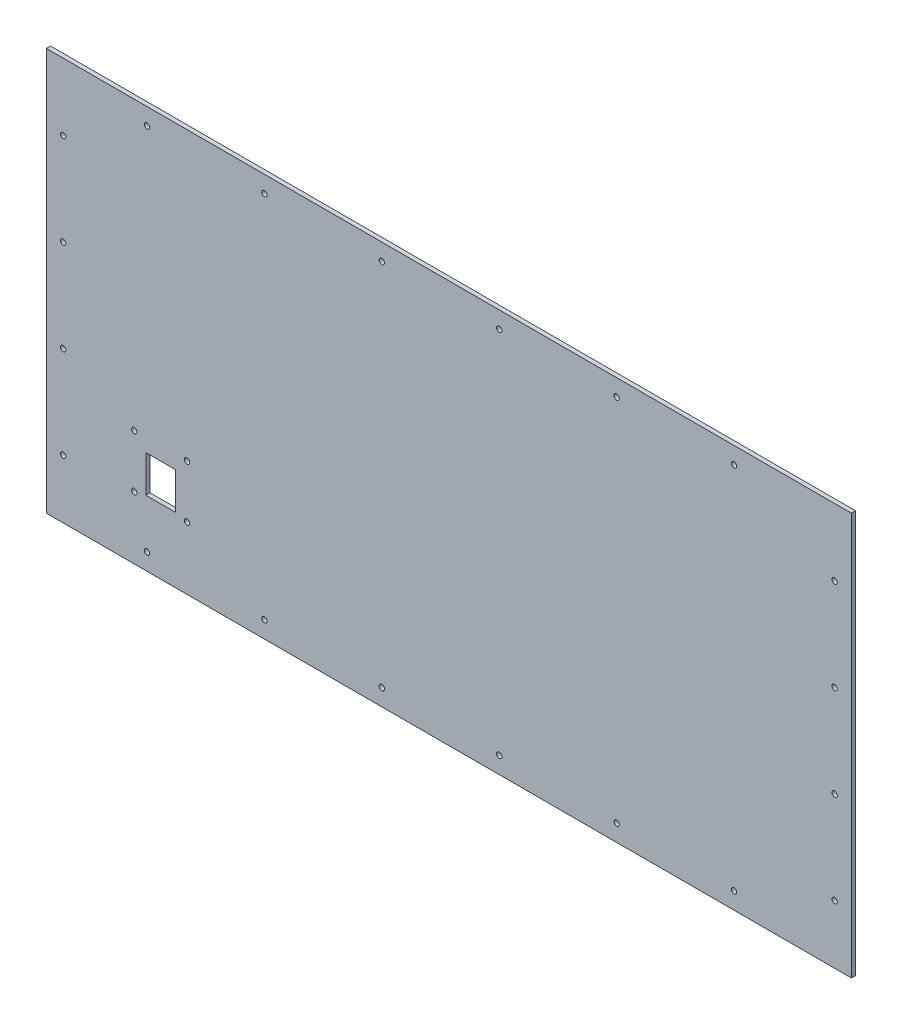
ISO-10303-21;
HEADER;
FILE_DESCRIPTION(('STEP AP214'),'2;1');
FILE_NAME('part.step','',(''),(''),'','','');
FILE_SCHEMA(('AUTOMOTIVE_DESIGN { 1 0 10303 214 1 1 1 1 }'));
ENDSEC;
DATA;
#1=APPLICATION_CONTEXT('core data for automotive mechanical design processes');
#2=APPLICATION_PROTOCOL_DEFINITION('international standard','automotive_design',2000,#1);
#3=PRODUCT_CONTEXT('',#1,'mechanical');
#4=PRODUCT('Part','Part','',(#3));
#5=PRODUCT_RELATED_PRODUCT_CATEGORY('part','',(#4));
#6=PRODUCT_DEFINITION_FORMATION('','',#4);
#7=PRODUCT_DEFINITION_CONTEXT('part definition',#1,'design');
#8=PRODUCT_DEFINITION('design','',#6,#7);
#9=PRODUCT_DEFINITION_SHAPE('','',#8);
#10=(LENGTH_UNIT() NAMED_UNIT(*) SI_UNIT(.MILLI.,.METRE.));
#11=(NAMED_UNIT(*) PLANE_ANGLE_UNIT() SI_UNIT($,.RADIAN.));
#12=(NAMED_UNIT(*) SI_UNIT($,.STERADIAN.) SOLID_ANGLE_UNIT());
#13=UNCERTAINTY_MEASURE_WITH_UNIT(LENGTH_MEASURE(1.E-05),#10,'distance_accuracy_value','');
#14=(GEOMETRIC_REPRESENTATION_CONTEXT(3) GLOBAL_UNCERTAINTY_ASSIGNED_CONTEXT((#13)) GLOBAL_UNIT_ASSIGNED_CONTEXT((#10,
#11,#12)) REPRESENTATION_CONTEXT('',''));
#15=CARTESIAN_POINT('',(0.,0.,0.));
#16=DIRECTION('',(0.,0.,1.));
#17=DIRECTION('',(1.,0.,0.));
#18=AXIS2_PLACEMENT_3D('',#15,#16,#17);
#19=CARTESIAN_POINT('',(0.,0.,3.175));
#20=DIRECTION('',(0.,0.,1.));
#21=DIRECTION('',(1.,0.,0.));
#22=AXIS2_PLACEMENT_3D('',#19,#20,#21);
#23=PLANE('',#22);
#24=CARTESIAN_POINT('',(-503.099999999998,87.45,3.175));
#25=DIRECTION('',(0.,0.,-1.));
#26=DIRECTION('',(-1.,0.,0.));
#27=AXIS2_PLACEMENT_3D('',#24,#25,#26);
#28=CIRCLE('',#27,2.03200000000001);
#29=CARTESIAN_POINT('',(-505.131999999998,87.45,3.175));
#30=VERTEX_POINT('',#29);
#31=EDGE_CURVE('E476',#30,#30,#28,.T.);
#32=ORIENTED_EDGE('',*,*,#31,.T.);
#33=EDGE_LOOP('',(#32));
#34=FACE_BOUND('',#33,.T.);
#35=CARTESIAN_POINT('',(-543.099999999998,87.45,3.175));
#36=DIRECTION('',(0.,0.,1.));
#37=DIRECTION('',(1.,0.,0.));
#38=AXIS2_PLACEMENT_3D('',#35,#36,#37);
#39=CIRCLE('',#38,2.03200000000001);
#40=CARTESIAN_POINT('',(-541.067999999998,87.45,3.175));
#41=VERTEX_POINT('',#40);
#42=EDGE_CURVE('E131',#41,#41,#39,.T.);
#43=ORIENTED_EDGE('',*,*,#42,.F.);
#44=EDGE_LOOP('',(#43));
#45=FACE_BOUND('',#44,.T.);
#46=DIRECTION('',(-1.,0.,0.));
#47=VECTOR('',#46,1.);
#48=CARTESIAN_POINT('',(-511.861674899003,77.3993363306747,3.175));
#49=LINE('',#48,#47);
#50=CARTESIAN_POINT('',(-511.861674899003,77.3993363306747,3.175));
#51=VERTEX_POINT('',#50);
#52=CARTESIAN_POINT('',(-534.338325100993,77.3993363306747,3.175));
#53=VERTEX_POINT('',#52);
#54=EDGE_CURVE('E51',#51,#53,#49,.T.);
#55=ORIENTED_EDGE('',*,*,#54,.F.);
#56=DIRECTION('',(0.,1.,0.));
#57=VECTOR('',#56,1.);
#58=CARTESIAN_POINT('',(-511.861674899003,49.45,3.175));
#59=LINE('',#58,#57);
#60=CARTESIAN_POINT('',(-511.861674899003,49.45,3.175));
#61=VERTEX_POINT('',#60);
#62=EDGE_CURVE('E118',#61,#51,#59,.T.);
#63=ORIENTED_EDGE('',*,*,#62,.F.);
#64=DIRECTION('',(-1.,0.,0.));
#65=VECTOR('',#64,1.);
#66=CARTESIAN_POINT('',(-511.861674899003,49.45,3.175));
#67=LINE('',#66,#65);
#68=CARTESIAN_POINT('',(-534.338325100993,49.45,3.175));
#69=VERTEX_POINT('',#68);
#70=EDGE_CURVE('E121',#61,#69,#67,.T.);
#71=ORIENTED_EDGE('',*,*,#70,.T.);
#72=DIRECTION('',(0.,1.,0.));
#73=VECTOR('',#72,1.);
#74=CARTESIAN_POINT('',(-534.338325100993,49.45,3.175));
#75=LINE('',#74,#73);
#76=EDGE_CURVE('E130',#69,#53,#75,.T.);
#77=ORIENTED_EDGE('',*,*,#76,.T.);
#78=EDGE_LOOP('',(#55,#63,#71,#77));
#79=FACE_BOUND('',#78,.T.);
#80=CARTESIAN_POINT('',(-596.899999999999,184.15,3.175));
#81=DIRECTION('',(0.,0.,1.));
#82=DIRECTION('',(1.,0.,0.));
#83=AXIS2_PLACEMENT_3D('',#80,#81,#82);
#84=CIRCLE('',#83,2.03200000000001);
#85=CARTESIAN_POINT('',(-594.867999999999,184.15,3.175));
#86=VERTEX_POINT('',#85);
#87=EDGE_CURVE('E163',#86,#86,#84,.T.);
#88=ORIENTED_EDGE('',*,*,#87,.F.);
#89=EDGE_LOOP('',(#88));
#90=FACE_BOUND('',#89,.T.);
#91=CARTESIAN_POINT('',(-596.899999999998,114.3,3.175));
#92=DIRECTION('',(0.,0.,1.));
#93=DIRECTION('',(1.,0.,0.));
#94=AXIS2_PLACEMENT_3D('',#91,#92,#93);
#95=CIRCLE('',#94,2.03200000000001);
#96=CARTESIAN_POINT('',(-594.867999999998,114.3,3.175));
#97=VERTEX_POINT('',#96);
#98=EDGE_CURVE('E169',#97,#97,#95,.T.);
#99=ORIENTED_EDGE('',*,*,#98,.F.);
#100=EDGE_LOOP('',(#99));
#101=FACE_BOUND('',#100,.T.);
#102=CARTESIAN_POINT('',(-596.899999999998,44.45,3.175));
#103=DIRECTION('',(0.,0.,1.));
#104=DIRECTION('',(1.,0.,0.));
#105=AXIS2_PLACEMENT_3D('',#102,#103,#104);
#106=CIRCLE('',#105,2.03200000000001);
#107=CARTESIAN_POINT('',(-594.867999999998,44.45,3.175));
#108=VERTEX_POINT('',#107);
#109=EDGE_CURVE('E175',#108,#108,#106,.T.);
#110=ORIENTED_EDGE('',*,*,#109,.F.);
#111=EDGE_LOOP('',(#110));
#112=FACE_BOUND('',#111,.T.);
#113=CARTESIAN_POINT('',(-12.7000000000024,44.4499999999998,3.175));
#114=DIRECTION('',(0.,0.,1.));
#115=DIRECTION('',(-1.,0.,0.));
#116=AXIS2_PLACEMENT_3D('',#113,#114,#115);
#117=CIRCLE('',#116,2.03200000000001);
#118=CARTESIAN_POINT('',(-14.7320000000024,44.4499999999998,3.175));
#119=VERTEX_POINT('',#118);
#120=EDGE_CURVE('E144',#119,#119,#117,.T.);
#121=ORIENTED_EDGE('',*,*,#120,.F.);
#122=EDGE_LOOP('',(#121));
#123=FACE_BOUND('',#122,.T.);
#124=CARTESIAN_POINT('',(-12.7000000000016,114.3,3.175));
#125=DIRECTION('',(0.,0.,1.));
#126=DIRECTION('',(-1.,0.,0.));
#127=AXIS2_PLACEMENT_3D('',#124,#125,#126);
#128=CIRCLE('',#127,2.03199999999991);
#129=CARTESIAN_POINT('',(-14.7320000000015,114.3,3.175));
#130=VERTEX_POINT('',#129);
#131=EDGE_CURVE('E145',#130,#130,#128,.T.);
#132=ORIENTED_EDGE('',*,*,#131,.F.);
#133=EDGE_LOOP('',(#132));
#134=FACE_BOUND('',#133,.T.);
#135=CARTESIAN_POINT('',(-12.7000000000008,184.15,3.175));
#136=DIRECTION('',(0.,0.,1.));
#137=DIRECTION('',(-1.,0.,0.));
#138=AXIS2_PLACEMENT_3D('',#135,#136,#137);
#139=CIRCLE('',#138,2.03200000000001);
#140=CARTESIAN_POINT('',(-14.7320000000008,184.15,3.175));
#141=VERTEX_POINT('',#140);
#142=EDGE_CURVE('E151',#141,#141,#139,.T.);
#143=ORIENTED_EDGE('',*,*,#142,.F.);
#144=EDGE_LOOP('',(#143));
#145=FACE_BOUND('',#144,.T.);
#146=CARTESIAN_POINT('',(-12.6999999999999,254.,3.175));
#147=DIRECTION('',(0.,0.,1.));
#148=DIRECTION('',(-1.,0.,0.));
#149=AXIS2_PLACEMENT_3D('',#146,#147,#148);
#150=CIRCLE('',#149,2.03200000000001);
#151=CARTESIAN_POINT('',(-14.7319999999999,254.,3.175));
#152=VERTEX_POINT('',#151);
#153=EDGE_CURVE('E137',#152,#152,#150,.T.);
#154=ORIENTED_EDGE('',*,*,#153,.F.);
#155=EDGE_LOOP('',(#154));
#156=FACE_BOUND('',#155,.T.);
#157=CARTESIAN_POINT('',(-596.9,254.,3.175));
#158=DIRECTION('',(0.,0.,1.));
#159=DIRECTION('',(1.,0.,0.));
#160=AXIS2_PLACEMENT_3D('',#157,#158,#159);
#161=CIRCLE('',#160,2.03200000000001);
#162=CARTESIAN_POINT('',(-594.868,254.,3.175));
#163=VERTEX_POINT('',#162);
#164=EDGE_CURVE('E162',#163,#163,#161,.T.);
#165=ORIENTED_EDGE('',*,*,#164,.F.);
#166=EDGE_LOOP('',(#165));
#167=FACE_BOUND('',#166,.T.);
#168=CARTESIAN_POINT('',(-266.7,292.1,3.175));
#169=DIRECTION('',(0.,0.,1.));
#170=DIRECTION('',(-1.,0.,0.));
#171=AXIS2_PLACEMENT_3D('',#168,#169,#170);
#172=CIRCLE('',#171,2.03200000000001);
#173=CARTESIAN_POINT('',(-268.732,292.1,3.175));
#174=VERTEX_POINT('',#173);
#175=EDGE_CURVE('E192',#174,#174,#172,.T.);
#176=ORIENTED_EDGE('',*,*,#175,.F.);
#177=EDGE_LOOP('',(#176));
#178=FACE_BOUND('',#177,.T.);
#179=CARTESIAN_POINT('',(-177.8,292.1,3.175));
#180=DIRECTION('',(0.,0.,1.));
#181=DIRECTION('',(-1.,0.,0.));
#182=AXIS2_PLACEMENT_3D('',#179,#180,#181);
#183=CIRCLE('',#182,2.032);
#184=CARTESIAN_POINT('',(-179.832,292.1,3.175));
#185=VERTEX_POINT('',#184);
#186=EDGE_CURVE('E223',#185,#185,#183,.T.);
#187=ORIENTED_EDGE('',*,*,#186,.F.);
#188=EDGE_LOOP('',(#187));
#189=FACE_BOUND('',#188,.T.);
#190=CARTESIAN_POINT('',(-88.9000000000005,292.1,3.175));
#191=DIRECTION('',(0.,0.,1.));
#192=DIRECTION('',(-1.,0.,0.));
#193=AXIS2_PLACEMENT_3D('',#190,#191,#192);
#194=CIRCLE('',#193,2.032);
#195=CARTESIAN_POINT('',(-90.9320000000005,292.1,3.175));
#196=VERTEX_POINT('',#195);
#197=EDGE_CURVE('E217',#196,#196,#194,.T.);
#198=ORIENTED_EDGE('',*,*,#197,.F.);
#199=EDGE_LOOP('',(#198));
#200=FACE_BOUND('',#199,.T.);
#201=CARTESIAN_POINT('',(-88.9000000000001,12.7,3.175));
#202=DIRECTION('',(0.,0.,1.));
#203=DIRECTION('',(1.,0.,0.));
#204=AXIS2_PLACEMENT_3D('',#201,#202,#203);
#205=CIRCLE('',#204,2.03200000000001);
#206=CARTESIAN_POINT('',(-86.8680000000001,12.7,3.175));
#207=VERTEX_POINT('',#206);
#208=EDGE_CURVE('E211',#207,#207,#205,.T.);
#209=ORIENTED_EDGE('',*,*,#208,.F.);
#210=EDGE_LOOP('',(#209));
#211=FACE_BOUND('',#210,.T.);
#212=CARTESIAN_POINT('',(-177.8,12.7,3.175));
#213=DIRECTION('',(0.,0.,1.));
#214=DIRECTION('',(1.,0.,0.));
#215=AXIS2_PLACEMENT_3D('',#212,#213,#214);
#216=CIRCLE('',#215,2.03200000000001);
#217=CARTESIAN_POINT('',(-175.768,12.7,3.175));
#218=VERTEX_POINT('',#217);
#219=EDGE_CURVE('E210',#218,#218,#216,.T.);
#220=ORIENTED_EDGE('',*,*,#219,.F.);
#221=EDGE_LOOP('',(#220));
#222=FACE_BOUND('',#221,.T.);
#223=CARTESIAN_POINT('',(-266.7,12.7,3.175));
#224=DIRECTION('',(0.,0.,1.));
#225=DIRECTION('',(1.,0.,0.));
#226=AXIS2_PLACEMENT_3D('',#223,#224,#225);
#227=CIRCLE('',#226,2.03200000000001);
#228=CARTESIAN_POINT('',(-264.668,12.7,3.175));
#229=VERTEX_POINT('',#228);
#230=EDGE_CURVE('E247',#229,#229,#227,.T.);
#231=ORIENTED_EDGE('',*,*,#230,.F.);
#232=EDGE_LOOP('',(#231));
#233=FACE_BOUND('',#232,.T.);
#234=CARTESIAN_POINT('',(-355.6,12.7,3.175));
#235=DIRECTION('',(0.,0.,1.));
#236=DIRECTION('',(1.,0.,0.));
#237=AXIS2_PLACEMENT_3D('',#234,#235,#236);
#238=CIRCLE('',#237,2.03200000000001);
#239=CARTESIAN_POINT('',(-353.568,12.7,3.175));
#240=VERTEX_POINT('',#239);
#241=EDGE_CURVE('E241',#240,#240,#238,.T.);
#242=ORIENTED_EDGE('',*,*,#241,.F.);
#243=EDGE_LOOP('',(#242));
#244=FACE_BOUND('',#243,.T.);
#245=CARTESIAN_POINT('',(-444.5,12.7,3.175));
#246=DIRECTION('',(0.,0.,1.));
#247=DIRECTION('',(1.,0.,0.));
#248=AXIS2_PLACEMENT_3D('',#245,#246,#247);
#249=CIRCLE('',#248,2.03200000000001);
#250=CARTESIAN_POINT('',(-442.468,12.7,3.175));
#251=VERTEX_POINT('',#250);
#252=EDGE_CURVE('E235',#251,#251,#249,.T.);
#253=ORIENTED_EDGE('',*,*,#252,.F.);
#254=EDGE_LOOP('',(#253));
#255=FACE_BOUND('',#254,.T.);
#256=CARTESIAN_POINT('',(-355.6,292.1,3.175));
#257=DIRECTION('',(0.,0.,1.));
#258=DIRECTION('',(-1.,0.,0.));
#259=AXIS2_PLACEMENT_3D('',#256,#257,#258);
#260=CIRCLE('',#259,2.03200000000001);
#261=CARTESIAN_POINT('',(-357.632,292.1,3.175));
#262=VERTEX_POINT('',#261);
#263=EDGE_CURVE('E193',#262,#262,#260,.T.);
#264=ORIENTED_EDGE('',*,*,#263,.F.);
#265=EDGE_LOOP('',(#264));
#266=FACE_BOUND('',#265,.T.);
#267=CARTESIAN_POINT('',(-444.5,292.1,3.175));
#268=DIRECTION('',(0.,0.,1.));
#269=DIRECTION('',(-1.,0.,0.));
#270=AXIS2_PLACEMENT_3D('',#267,#268,#269);
#271=CIRCLE('',#270,2.03200000000001);
#272=CARTESIAN_POINT('',(-446.532,292.1,3.175));
#273=VERTEX_POINT('',#272);
#274=EDGE_CURVE('E199',#273,#273,#271,.T.);
#275=ORIENTED_EDGE('',*,*,#274,.F.);
#276=EDGE_LOOP('',(#275));
#277=FACE_BOUND('',#276,.T.);
#278=CARTESIAN_POINT('',(-533.4,292.1,3.175));
#279=DIRECTION('',(0.,0.,1.));
#280=DIRECTION('',(-1.,0.,0.));
#281=AXIS2_PLACEMENT_3D('',#278,#279,#280);
#282=CIRCLE('',#281,2.03200000000001);
#283=CARTESIAN_POINT('',(-535.432,292.1,3.175));
#284=VERTEX_POINT('',#283);
#285=EDGE_CURVE('E186',#284,#284,#282,.T.);
#286=ORIENTED_EDGE('',*,*,#285,.F.);
#287=EDGE_LOOP('',(#286));
#288=FACE_BOUND('',#287,.T.);
#289=CARTESIAN_POINT('',(-533.4,12.7,3.175));
#290=DIRECTION('',(0.,0.,1.));
#291=DIRECTION('',(1.,0.,0.));
#292=AXIS2_PLACEMENT_3D('',#289,#290,#291);
#293=CIRCLE('',#292,2.03200000000001);
#294=CARTESIAN_POINT('',(-531.368,12.7,3.175));
#295=VERTEX_POINT('',#294);
#296=EDGE_CURVE('E234',#295,#295,#293,.T.);
#297=ORIENTED_EDGE('',*,*,#296,.F.);
#298=EDGE_LOOP('',(#297));
#299=FACE_BOUND('',#298,.T.);
#300=DIRECTION('',(0.,1.,0.));
#301=VECTOR('',#300,1.);
#302=CARTESIAN_POINT('',(0.,0.,3.175));
#303=LINE('',#302,#301);
#304=CARTESIAN_POINT('',(0.,0.,3.175));
#305=VERTEX_POINT('',#304);
#306=CARTESIAN_POINT('',(0.,304.8,3.175));
#307=VERTEX_POINT('',#306);
#308=EDGE_CURVE('E261',#305,#307,#303,.T.);
#309=ORIENTED_EDGE('',*,*,#308,.T.);
#310=DIRECTION('',(-1.,0.,0.));
#311=VECTOR('',#310,1.);
#312=CARTESIAN_POINT('',(0.,304.8,3.175));
#313=LINE('',#312,#311);
#314=CARTESIAN_POINT('',(-609.6,304.8,3.175));
#315=VERTEX_POINT('',#314);
#316=EDGE_CURVE('E264',#307,#315,#313,.T.);
#317=ORIENTED_EDGE('',*,*,#316,.T.);
#318=DIRECTION('',(0.,-1.,0.));
#319=VECTOR('',#318,1.);
#320=CARTESIAN_POINT('',(-609.6,0.,3.175));
#321=LINE('',#320,#319);
#322=CARTESIAN_POINT('',(-609.6,0.,3.175));
#323=VERTEX_POINT('',#322);
#324=EDGE_CURVE('E267',#315,#323,#321,.T.);
#325=ORIENTED_EDGE('',*,*,#324,.T.);
#326=DIRECTION('',(1.,0.,0.));
#327=VECTOR('',#326,1.);
#328=CARTESIAN_POINT('',(0.,0.,3.175));
#329=LINE('',#328,#327);
#330=EDGE_CURVE('E269',#323,#305,#329,.T.);
#331=ORIENTED_EDGE('',*,*,#330,.T.);
#332=EDGE_LOOP('',(#309,#317,#325,#331));
#333=FACE_BOUND('',#332,.T.);
#334=CARTESIAN_POINT('',(-503.099999999998,47.45,3.175));
#335=DIRECTION('',(0.,0.,1.));
#336=DIRECTION('',(1.,0.,0.));
#337=AXIS2_PLACEMENT_3D('',#334,#335,#336);
#338=CIRCLE('',#337,2.03200000000001);
#339=CARTESIAN_POINT('',(-501.067999999998,47.45,3.175));
#340=VERTEX_POINT('',#339);
#341=EDGE_CURVE('E483',#340,#340,#338,.T.);
#342=ORIENTED_EDGE('',*,*,#341,.F.);
#343=EDGE_LOOP('',(#342));
#344=FACE_BOUND('',#343,.T.);
#345=CARTESIAN_POINT('',(-543.099999999998,47.45,3.175));
#346=DIRECTION('',(0.,0.,-1.));
#347=DIRECTION('',(-1.,0.,0.));
#348=AXIS2_PLACEMENT_3D('',#345,#346,#347);
#349=CIRCLE('',#348,2.03200000000001);
#350=CARTESIAN_POINT('',(-545.131999999998,47.45,3.175));
#351=VERTEX_POINT('',#350);
#352=EDGE_CURVE('E488',#351,#351,#349,.T.);
#353=ORIENTED_EDGE('',*,*,#352,.T.);
#354=EDGE_LOOP('',(#353));
#355=FACE_BOUND('',#354,.T.);
#356=ADVANCED_FACE('F36',(#34,#45,#79,#90,#101,#112,#123,#134,#145,#156,#167,#178,#189,#200,
#211,#222,#233,#244,#255,#266,#277,#288,#299,#333,#344,#355),#23,.T.);
#357=CARTESIAN_POINT('',(0.,0.,0.));
#358=DIRECTION('',(0.,0.,1.));
#359=DIRECTION('',(1.,0.,0.));
#360=AXIS2_PLACEMENT_3D('',#357,#358,#359);
#361=PLANE('',#360);
#362=CARTESIAN_POINT('',(-503.099999999998,47.45,0.));
#363=DIRECTION('',(0.,0.,1.));
#364=DIRECTION('',(1.,0.,0.));
#365=AXIS2_PLACEMENT_3D('',#362,#363,#364);
#366=CIRCLE('',#365,2.03200000000001);
#367=CARTESIAN_POINT('',(-501.067999999998,47.45,0.));
#368=VERTEX_POINT('',#367);
#369=EDGE_CURVE('E486',#368,#368,#366,.T.);
#370=ORIENTED_EDGE('',*,*,#369,.T.);
#371=EDGE_LOOP('',(#370));
#372=FACE_BOUND('',#371,.T.);
#373=CARTESIAN_POINT('',(-543.099999999998,87.45,0.));
#374=DIRECTION('',(0.,0.,1.));
#375=DIRECTION('',(1.,0.,0.));
#376=AXIS2_PLACEMENT_3D('',#373,#374,#375);
#377=CIRCLE('',#376,2.03200000000001);
#378=CARTESIAN_POINT('',(-541.067999999998,87.45,0.));
#379=VERTEX_POINT('',#378);
#380=EDGE_CURVE('E472',#379,#379,#377,.T.);
#381=ORIENTED_EDGE('',*,*,#380,.T.);
#382=EDGE_LOOP('',(#381));
#383=FACE_BOUND('',#382,.T.);
#384=DIRECTION('',(0.,1.,0.));
#385=VECTOR('',#384,1.);
#386=CARTESIAN_POINT('',(-511.861674899003,49.45,0.));
#387=LINE('',#386,#385);
#388=CARTESIAN_POINT('',(-511.861674899003,49.45,0.));
#389=VERTEX_POINT('',#388);
#390=CARTESIAN_POINT('',(-511.861674899003,77.3993363306747,0.));
#391=VERTEX_POINT('',#390);
#392=EDGE_CURVE('E113',#389,#391,#387,.T.);
#393=ORIENTED_EDGE('',*,*,#392,.T.);
#394=DIRECTION('',(-1.,0.,0.));
#395=VECTOR('',#394,1.);
#396=CARTESIAN_POINT('',(-511.861674899003,77.3993363306747,0.));
#397=LINE('',#396,#395);
#398=CARTESIAN_POINT('',(-534.338325100993,77.3993363306747,0.));
#399=VERTEX_POINT('',#398);
#400=EDGE_CURVE('E108',#391,#399,#397,.T.);
#401=ORIENTED_EDGE('',*,*,#400,.T.);
#402=DIRECTION('',(0.,1.,0.));
#403=VECTOR('',#402,1.);
#404=CARTESIAN_POINT('',(-534.338325100993,49.45,0.));
#405=LINE('',#404,#403);
#406=CARTESIAN_POINT('',(-534.338325100993,49.45,0.));
#407=VERTEX_POINT('',#406);
#408=EDGE_CURVE('E100',#407,#399,#405,.T.);
#409=ORIENTED_EDGE('',*,*,#408,.F.);
#410=DIRECTION('',(-1.,0.,0.));
#411=VECTOR('',#410,1.);
#412=CARTESIAN_POINT('',(-511.861674899003,49.45,0.));
#413=LINE('',#412,#411);
#414=EDGE_CURVE('E107',#389,#407,#413,.T.);
#415=ORIENTED_EDGE('',*,*,#414,.F.);
#416=EDGE_LOOP('',(#393,#401,#409,#415));
#417=FACE_BOUND('',#416,.T.);
#418=CARTESIAN_POINT('',(-596.899999999999,184.15,0.));
#419=DIRECTION('',(0.,0.,1.));
#420=DIRECTION('',(1.,0.,0.));
#421=AXIS2_PLACEMENT_3D('',#418,#419,#420);
#422=CIRCLE('',#421,2.03200000000001);
#423=CARTESIAN_POINT('',(-594.867999999999,184.15,0.));
#424=VERTEX_POINT('',#423);
#425=EDGE_CURVE('E159',#424,#424,#422,.T.);
#426=ORIENTED_EDGE('',*,*,#425,.T.);
#427=EDGE_LOOP('',(#426));
#428=FACE_BOUND('',#427,.T.);
#429=CARTESIAN_POINT('',(-596.899999999998,114.3,0.));
#430=DIRECTION('',(0.,0.,1.));
#431=DIRECTION('',(1.,0.,0.));
#432=AXIS2_PLACEMENT_3D('',#429,#430,#431);
#433=CIRCLE('',#432,2.03200000000001);
#434=CARTESIAN_POINT('',(-594.867999999998,114.3,0.));
#435=VERTEX_POINT('',#434);
#436=EDGE_CURVE('E166',#435,#435,#433,.T.);
#437=ORIENTED_EDGE('',*,*,#436,.T.);
#438=EDGE_LOOP('',(#437));
#439=FACE_BOUND('',#438,.T.);
#440=CARTESIAN_POINT('',(-596.899999999998,44.45,0.));
#441=DIRECTION('',(0.,0.,1.));
#442=DIRECTION('',(1.,0.,0.));
#443=AXIS2_PLACEMENT_3D('',#440,#441,#442);
#444=CIRCLE('',#443,2.03200000000001);
#445=CARTESIAN_POINT('',(-594.867999999998,44.45,0.));
#446=VERTEX_POINT('',#445);
#447=EDGE_CURVE('E172',#446,#446,#444,.T.);
#448=ORIENTED_EDGE('',*,*,#447,.T.);
#449=EDGE_LOOP('',(#448));
#450=FACE_BOUND('',#449,.T.);
#451=CARTESIAN_POINT('',(-12.7000000000024,44.4499999999998,0.));
#452=DIRECTION('',(0.,0.,1.));
#453=DIRECTION('',(-1.,0.,0.));
#454=AXIS2_PLACEMENT_3D('',#451,#452,#453);
#455=CIRCLE('',#454,2.03200000000001);
#456=CARTESIAN_POINT('',(-14.7320000000024,44.4499999999998,0.));
#457=VERTEX_POINT('',#456);
#458=EDGE_CURVE('E178',#457,#457,#455,.T.);
#459=ORIENTED_EDGE('',*,*,#458,.T.);
#460=EDGE_LOOP('',(#459));
#461=FACE_BOUND('',#460,.T.);
#462=CARTESIAN_POINT('',(-12.7000000000016,114.3,0.));
#463=DIRECTION('',(0.,0.,1.));
#464=DIRECTION('',(-1.,0.,0.));
#465=AXIS2_PLACEMENT_3D('',#462,#463,#464);
#466=CIRCLE('',#465,2.03199999999991);
#467=CARTESIAN_POINT('',(-14.7320000000015,114.3,0.));
#468=VERTEX_POINT('',#467);
#469=EDGE_CURVE('E141',#468,#468,#466,.T.);
#470=ORIENTED_EDGE('',*,*,#469,.T.);
#471=EDGE_LOOP('',(#470));
#472=FACE_BOUND('',#471,.T.);
#473=CARTESIAN_POINT('',(-12.7000000000008,184.15,0.));
#474=DIRECTION('',(0.,0.,1.));
#475=DIRECTION('',(-1.,0.,0.));
#476=AXIS2_PLACEMENT_3D('',#473,#474,#475);
#477=CIRCLE('',#476,2.03200000000001);
#478=CARTESIAN_POINT('',(-14.7320000000008,184.15,0.));
#479=VERTEX_POINT('',#478);
#480=EDGE_CURVE('E148',#479,#479,#477,.T.);
#481=ORIENTED_EDGE('',*,*,#480,.T.);
#482=EDGE_LOOP('',(#481));
#483=FACE_BOUND('',#482,.T.);
#484=CARTESIAN_POINT('',(-12.6999999999999,254.,0.));
#485=DIRECTION('',(0.,0.,1.));
#486=DIRECTION('',(-1.,0.,0.));
#487=AXIS2_PLACEMENT_3D('',#484,#485,#486);
#488=CIRCLE('',#487,2.03200000000001);
#489=CARTESIAN_POINT('',(-14.7319999999999,254.,0.));
#490=VERTEX_POINT('',#489);
#491=EDGE_CURVE('E154',#490,#490,#488,.T.);
#492=ORIENTED_EDGE('',*,*,#491,.T.);
#493=EDGE_LOOP('',(#492));
#494=FACE_BOUND('',#493,.T.);
#495=CARTESIAN_POINT('',(-596.9,254.,0.));
#496=DIRECTION('',(0.,0.,1.));
#497=DIRECTION('',(1.,0.,0.));
#498=AXIS2_PLACEMENT_3D('',#495,#496,#497);
#499=CIRCLE('',#498,2.03200000000001);
#500=CARTESIAN_POINT('',(-594.868,254.,0.));
#501=VERTEX_POINT('',#500);
#502=EDGE_CURVE('E183',#501,#501,#499,.T.);
#503=ORIENTED_EDGE('',*,*,#502,.T.);
#504=EDGE_LOOP('',(#503));
#505=FACE_BOUND('',#504,.T.);
#506=CARTESIAN_POINT('',(-266.7,292.1,0.));
#507=DIRECTION('',(0.,0.,1.));
#508=DIRECTION('',(-1.,0.,0.));
#509=AXIS2_PLACEMENT_3D('',#506,#507,#508);
#510=CIRCLE('',#509,2.03200000000001);
#511=CARTESIAN_POINT('',(-268.732,292.1,0.));
#512=VERTEX_POINT('',#511);
#513=EDGE_CURVE('E226',#512,#512,#510,.T.);
#514=ORIENTED_EDGE('',*,*,#513,.T.);
#515=EDGE_LOOP('',(#514));
#516=FACE_BOUND('',#515,.T.);
#517=CARTESIAN_POINT('',(-177.8,292.1,0.));
#518=DIRECTION('',(0.,0.,1.));
#519=DIRECTION('',(-1.,0.,0.));
#520=AXIS2_PLACEMENT_3D('',#517,#518,#519);
#521=CIRCLE('',#520,2.032);
#522=CARTESIAN_POINT('',(-179.832,292.1,0.));
#523=VERTEX_POINT('',#522);
#524=EDGE_CURVE('E220',#523,#523,#521,.T.);
#525=ORIENTED_EDGE('',*,*,#524,.T.);
#526=EDGE_LOOP('',(#525));
#527=FACE_BOUND('',#526,.T.);
#528=CARTESIAN_POINT('',(-88.9000000000005,292.1,0.));
#529=DIRECTION('',(0.,0.,1.));
#530=DIRECTION('',(-1.,0.,0.));
#531=AXIS2_PLACEMENT_3D('',#528,#529,#530);
#532=CIRCLE('',#531,2.032);
#533=CARTESIAN_POINT('',(-90.9320000000005,292.1,0.));
#534=VERTEX_POINT('',#533);
#535=EDGE_CURVE('E214',#534,#534,#532,.T.);
#536=ORIENTED_EDGE('',*,*,#535,.T.);
#537=EDGE_LOOP('',(#536));
#538=FACE_BOUND('',#537,.T.);
#539=CARTESIAN_POINT('',(-88.9000000000001,12.7,0.));
#540=DIRECTION('',(0.,0.,1.));
#541=DIRECTION('',(1.,0.,0.));
#542=AXIS2_PLACEMENT_3D('',#539,#540,#541);
#543=CIRCLE('',#542,2.03200000000001);
#544=CARTESIAN_POINT('',(-86.8680000000001,12.7,0.));
#545=VERTEX_POINT('',#544);
#546=EDGE_CURVE('E207',#545,#545,#543,.T.);
#547=ORIENTED_EDGE('',*,*,#546,.T.);
#548=EDGE_LOOP('',(#547));
#549=FACE_BOUND('',#548,.T.);
#550=CARTESIAN_POINT('',(-177.8,12.7,0.));
#551=DIRECTION('',(0.,0.,1.));
#552=DIRECTION('',(1.,0.,0.));
#553=AXIS2_PLACEMENT_3D('',#550,#551,#552);
#554=CIRCLE('',#553,2.03200000000001);
#555=CARTESIAN_POINT('',(-175.768,12.7,0.));
#556=VERTEX_POINT('',#555);
#557=EDGE_CURVE('E250',#556,#556,#554,.T.);
#558=ORIENTED_EDGE('',*,*,#557,.T.);
#559=EDGE_LOOP('',(#558));
#560=FACE_BOUND('',#559,.T.);
#561=CARTESIAN_POINT('',(-266.7,12.7,0.));
#562=DIRECTION('',(0.,0.,1.));
#563=DIRECTION('',(1.,0.,0.));
#564=AXIS2_PLACEMENT_3D('',#561,#562,#563);
#565=CIRCLE('',#564,2.03200000000001);
#566=CARTESIAN_POINT('',(-264.668,12.7,0.));
#567=VERTEX_POINT('',#566);
#568=EDGE_CURVE('E244',#567,#567,#565,.T.);
#569=ORIENTED_EDGE('',*,*,#568,.T.);
#570=EDGE_LOOP('',(#569));
#571=FACE_BOUND('',#570,.T.);
#572=CARTESIAN_POINT('',(-355.6,12.7,0.));
#573=DIRECTION('',(0.,0.,1.));
#574=DIRECTION('',(1.,0.,0.));
#575=AXIS2_PLACEMENT_3D('',#572,#573,#574);
#576=CIRCLE('',#575,2.03200000000001);
#577=CARTESIAN_POINT('',(-353.568,12.7,0.));
#578=VERTEX_POINT('',#577);
#579=EDGE_CURVE('E238',#578,#578,#576,.T.);
#580=ORIENTED_EDGE('',*,*,#579,.T.);
#581=EDGE_LOOP('',(#580));
#582=FACE_BOUND('',#581,.T.);
#583=CARTESIAN_POINT('',(-444.5,12.7,0.));
#584=DIRECTION('',(0.,0.,1.));
#585=DIRECTION('',(1.,0.,0.));
#586=AXIS2_PLACEMENT_3D('',#583,#584,#585);
#587=CIRCLE('',#586,2.03200000000001);
#588=CARTESIAN_POINT('',(-442.468,12.7,0.));
#589=VERTEX_POINT('',#588);
#590=EDGE_CURVE('E231',#589,#589,#587,.T.);
#591=ORIENTED_EDGE('',*,*,#590,.T.);
#592=EDGE_LOOP('',(#591));
#593=FACE_BOUND('',#592,.T.);
#594=CARTESIAN_POINT('',(-355.6,292.1,0.));
#595=DIRECTION('',(0.,0.,1.));
#596=DIRECTION('',(-1.,0.,0.));
#597=AXIS2_PLACEMENT_3D('',#594,#595,#596);
#598=CIRCLE('',#597,2.03200000000001);
#599=CARTESIAN_POINT('',(-357.632,292.1,0.));
#600=VERTEX_POINT('',#599);
#601=EDGE_CURVE('E189',#600,#600,#598,.T.);
#602=ORIENTED_EDGE('',*,*,#601,.T.);
#603=EDGE_LOOP('',(#602));
#604=FACE_BOUND('',#603,.T.);
#605=CARTESIAN_POINT('',(-444.5,292.1,0.));
#606=DIRECTION('',(0.,0.,1.));
#607=DIRECTION('',(-1.,0.,0.));
#608=AXIS2_PLACEMENT_3D('',#605,#606,#607);
#609=CIRCLE('',#608,2.03200000000001);
#610=CARTESIAN_POINT('',(-446.532,292.1,0.));
#611=VERTEX_POINT('',#610);
#612=EDGE_CURVE('E196',#611,#611,#609,.T.);
#613=ORIENTED_EDGE('',*,*,#612,.T.);
#614=EDGE_LOOP('',(#613));
#615=FACE_BOUND('',#614,.T.);
#616=CARTESIAN_POINT('',(-533.4,292.1,0.));
#617=DIRECTION('',(0.,0.,1.));
#618=DIRECTION('',(-1.,0.,0.));
#619=AXIS2_PLACEMENT_3D('',#616,#617,#618);
#620=CIRCLE('',#619,2.03200000000001);
#621=CARTESIAN_POINT('',(-535.432,292.1,0.));
#622=VERTEX_POINT('',#621);
#623=EDGE_CURVE('E202',#622,#622,#620,.T.);
#624=ORIENTED_EDGE('',*,*,#623,.T.);
#625=EDGE_LOOP('',(#624));
#626=FACE_BOUND('',#625,.T.);
#627=CARTESIAN_POINT('',(-533.4,12.7,0.));
#628=DIRECTION('',(0.,0.,1.));
#629=DIRECTION('',(1.,0.,0.));
#630=AXIS2_PLACEMENT_3D('',#627,#628,#629);
#631=CIRCLE('',#630,2.03200000000001);
#632=CARTESIAN_POINT('',(-531.368,12.7,0.));
#633=VERTEX_POINT('',#632);
#634=EDGE_CURVE('E255',#633,#633,#631,.T.);
#635=ORIENTED_EDGE('',*,*,#634,.T.);
#636=EDGE_LOOP('',(#635));
#637=FACE_BOUND('',#636,.T.);
#638=DIRECTION('',(0.,1.,0.));
#639=VECTOR('',#638,1.);
#640=CARTESIAN_POINT('',(0.,0.,0.));
#641=LINE('',#640,#639);
#642=CARTESIAN_POINT('',(0.,0.,0.));
#643=VERTEX_POINT('',#642);
#644=CARTESIAN_POINT('',(0.,304.8,0.));
#645=VERTEX_POINT('',#644);
#646=EDGE_CURVE('E258',#643,#645,#641,.T.);
#647=ORIENTED_EDGE('',*,*,#646,.F.);
#648=DIRECTION('',(1.,0.,0.));
#649=VECTOR('',#648,1.);
#650=CARTESIAN_POINT('',(0.,0.,0.));
#651=LINE('',#650,#649);
#652=CARTESIAN_POINT('',(-609.6,0.,0.));
#653=VERTEX_POINT('',#652);
#654=EDGE_CURVE('E265',#653,#643,#651,.T.);
#655=ORIENTED_EDGE('',*,*,#654,.F.);
#656=DIRECTION('',(0.,-1.,0.));
#657=VECTOR('',#656,1.);
#658=CARTESIAN_POINT('',(-609.6,0.,0.));
#659=LINE('',#658,#657);
#660=CARTESIAN_POINT('',(-609.6,304.8,0.));
#661=VERTEX_POINT('',#660);
#662=EDGE_CURVE('E276',#661,#653,#659,.T.);
#663=ORIENTED_EDGE('',*,*,#662,.F.);
#664=DIRECTION('',(-1.,0.,0.));
#665=VECTOR('',#664,1.);
#666=CARTESIAN_POINT('',(0.,304.8,0.));
#667=LINE('',#666,#665);
#668=EDGE_CURVE('E274',#645,#661,#667,.T.);
#669=ORIENTED_EDGE('',*,*,#668,.F.);
#670=EDGE_LOOP('',(#647,#655,#663,#669));
#671=FACE_BOUND('',#670,.T.);
#672=CARTESIAN_POINT('',(-503.099999999998,87.45,0.));
#673=DIRECTION('',(0.,0.,-1.));
#674=DIRECTION('',(-1.,0.,0.));
#675=AXIS2_PLACEMENT_3D('',#672,#673,#674);
#676=CIRCLE('',#675,2.03200000000001);
#677=CARTESIAN_POINT('',(-505.131999999998,87.45,0.));
#678=VERTEX_POINT('',#677);
#679=EDGE_CURVE('E480',#678,#678,#676,.T.);
#680=ORIENTED_EDGE('',*,*,#679,.F.);
#681=EDGE_LOOP('',(#680));
#682=FACE_BOUND('',#681,.T.);
#683=CARTESIAN_POINT('',(-543.099999999998,47.45,0.));
#684=DIRECTION('',(0.,0.,-1.));
#685=DIRECTION('',(-1.,0.,0.));
#686=AXIS2_PLACEMENT_3D('',#683,#684,#685);
#687=CIRCLE('',#686,2.03200000000001);
#688=CARTESIAN_POINT('',(-545.131999999998,47.45,0.));
#689=VERTEX_POINT('',#688);
#690=EDGE_CURVE('E124',#689,#689,#687,.T.);
#691=ORIENTED_EDGE('',*,*,#690,.F.);
#692=EDGE_LOOP('',(#691));
#693=FACE_BOUND('',#692,.T.);
#694=ADVANCED_FACE('F115',(#372,#383,#417,#428,#439,#450,#461,#472,#483,#494,#505,#516,#527,
#538,#549,#560,#571,#582,#593,#604,#615,#626,#637,#671,#682,#693),#361,.F.);
#695=CARTESIAN_POINT('',(0.,0.,3.175));
#696=DIRECTION('',(-1.,0.,0.));
#697=DIRECTION('',(0.,0.,1.));
#698=AXIS2_PLACEMENT_3D('',#695,#696,#697);
#699=PLANE('',#698);
#700=ORIENTED_EDGE('',*,*,#646,.T.);
#701=DIRECTION('',(0.,0.,-1.));
#702=VECTOR('',#701,1.);
#703=CARTESIAN_POINT('',(0.,304.8,3.175));
#704=LINE('',#703,#702);
#705=EDGE_CURVE('E11',#307,#645,#704,.T.);
#706=ORIENTED_EDGE('',*,*,#705,.F.);
#707=ORIENTED_EDGE('',*,*,#308,.F.);
#708=DIRECTION('',(0.,0.,-1.));
#709=VECTOR('',#708,1.);
#710=CARTESIAN_POINT('',(0.,0.,3.175));
#711=LINE('',#710,#709);
#712=EDGE_CURVE('E271',#305,#643,#711,.T.);
#713=ORIENTED_EDGE('',*,*,#712,.T.);
#714=EDGE_LOOP('',(#700,#706,#707,#713));
#715=FACE_BOUND('',#714,.T.);
#716=ADVANCED_FACE('F38',(#715),#699,.F.);
#717=CARTESIAN_POINT('',(0.,304.8,3.175));
#718=DIRECTION('',(0.,-1.,0.));
#719=DIRECTION('',(1.,0.,0.));
#720=AXIS2_PLACEMENT_3D('',#717,#718,#719);
#721=PLANE('',#720);
#722=ORIENTED_EDGE('',*,*,#668,.T.);
#723=DIRECTION('',(0.,0.,-1.));
#724=VECTOR('',#723,1.);
#725=CARTESIAN_POINT('',(-609.6,304.8,3.175));
#726=LINE('',#725,#724);
#727=EDGE_CURVE('E44',#315,#661,#726,.T.);
#728=ORIENTED_EDGE('',*,*,#727,.F.);
#729=ORIENTED_EDGE('',*,*,#316,.F.);
#730=ORIENTED_EDGE('',*,*,#705,.T.);
#731=EDGE_LOOP('',(#722,#728,#729,#730));
#732=FACE_BOUND('',#731,.T.);
#733=ADVANCED_FACE('F304',(#732),#721,.F.);
#734=CARTESIAN_POINT('',(-609.6,0.,3.175));
#735=DIRECTION('',(1.,0.,0.));
#736=DIRECTION('',(0.,0.,-1.));
#737=AXIS2_PLACEMENT_3D('',#734,#735,#736);
#738=PLANE('',#737);
#739=ORIENTED_EDGE('',*,*,#662,.T.);
#740=DIRECTION('',(0.,0.,-1.));
#741=VECTOR('',#740,1.);
#742=CARTESIAN_POINT('',(-609.6,0.,3.175));
#743=LINE('',#742,#741);
#744=EDGE_CURVE('E281',#323,#653,#743,.T.);
#745=ORIENTED_EDGE('',*,*,#744,.F.);
#746=ORIENTED_EDGE('',*,*,#324,.F.);
#747=ORIENTED_EDGE('',*,*,#727,.T.);
#748=EDGE_LOOP('',(#739,#745,#746,#747));
#749=FACE_BOUND('',#748,.T.);
#750=ADVANCED_FACE('F288',(#749),#738,.F.);
#751=CARTESIAN_POINT('',(0.,0.,3.175));
#752=DIRECTION('',(0.,1.,0.));
#753=DIRECTION('',(0.,0.,1.));
#754=AXIS2_PLACEMENT_3D('',#751,#752,#753);
#755=PLANE('',#754);
#756=ORIENTED_EDGE('',*,*,#654,.T.);
#757=ORIENTED_EDGE('',*,*,#712,.F.);
#758=ORIENTED_EDGE('',*,*,#330,.F.);
#759=ORIENTED_EDGE('',*,*,#744,.T.);
#760=EDGE_LOOP('',(#756,#757,#758,#759));
#761=FACE_BOUND('',#760,.T.);
#762=ADVANCED_FACE('F297',(#761),#755,.F.);
#763=CARTESIAN_POINT('',(-533.4,12.7,0.));
#764=DIRECTION('',(0.,0.,1.));
#765=DIRECTION('',(1.,0.,0.));
#766=AXIS2_PLACEMENT_3D('',#763,#764,#765);
#767=CYLINDRICAL_SURFACE('',#766,2.03200000000001);
#768=ORIENTED_EDGE('',*,*,#634,.F.);
#769=EDGE_LOOP('',(#768));
#770=FACE_BOUND('',#769,.T.);
#771=ORIENTED_EDGE('',*,*,#296,.T.);
#772=EDGE_LOOP('',(#771));
#773=FACE_BOUND('',#772,.T.);
#774=ADVANCED_FACE('F322',(#770,#773),#767,.F.);
#775=CARTESIAN_POINT('',(-533.4,292.1,0.));
#776=DIRECTION('',(0.,0.,1.));
#777=DIRECTION('',(1.,0.,0.));
#778=AXIS2_PLACEMENT_3D('',#775,#776,#777);
#779=CYLINDRICAL_SURFACE('',#778,2.03200000000001);
#780=ORIENTED_EDGE('',*,*,#623,.F.);
#781=EDGE_LOOP('',(#780));
#782=FACE_BOUND('',#781,.T.);
#783=ORIENTED_EDGE('',*,*,#285,.T.);
#784=EDGE_LOOP('',(#783));
#785=FACE_BOUND('',#784,.T.);
#786=ADVANCED_FACE('F329',(#782,#785),#779,.F.);
#787=CARTESIAN_POINT('',(-444.5,292.1,0.));
#788=DIRECTION('',(0.,0.,1.));
#789=DIRECTION('',(1.,0.,0.));
#790=AXIS2_PLACEMENT_3D('',#787,#788,#789);
#791=CYLINDRICAL_SURFACE('',#790,2.03200000000001);
#792=ORIENTED_EDGE('',*,*,#612,.F.);
#793=EDGE_LOOP('',(#792));
#794=FACE_BOUND('',#793,.T.);
#795=ORIENTED_EDGE('',*,*,#274,.T.);
#796=EDGE_LOOP('',(#795));
#797=FACE_BOUND('',#796,.T.);
#798=ADVANCED_FACE('F334',(#794,#797),#791,.F.);
#799=CARTESIAN_POINT('',(-355.6,292.1,0.));
#800=DIRECTION('',(0.,0.,1.));
#801=DIRECTION('',(1.,0.,0.));
#802=AXIS2_PLACEMENT_3D('',#799,#800,#801);
#803=CYLINDRICAL_SURFACE('',#802,2.03200000000001);
#804=ORIENTED_EDGE('',*,*,#601,.F.);
#805=EDGE_LOOP('',(#804));
#806=FACE_BOUND('',#805,.T.);
#807=ORIENTED_EDGE('',*,*,#263,.T.);
#808=EDGE_LOOP('',(#807));
#809=FACE_BOUND('',#808,.T.);
#810=ADVANCED_FACE('F345',(#806,#809),#803,.F.);
#811=CARTESIAN_POINT('',(-444.5,12.7,0.));
#812=DIRECTION('',(0.,0.,1.));
#813=DIRECTION('',(1.,0.,0.));
#814=AXIS2_PLACEMENT_3D('',#811,#812,#813);
#815=CYLINDRICAL_SURFACE('',#814,2.03200000000001);
#816=ORIENTED_EDGE('',*,*,#590,.F.);
#817=EDGE_LOOP('',(#816));
#818=FACE_BOUND('',#817,.T.);
#819=ORIENTED_EDGE('',*,*,#252,.T.);
#820=EDGE_LOOP('',(#819));
#821=FACE_BOUND('',#820,.T.);
#822=ADVANCED_FACE('F370',(#818,#821),#815,.F.);
#823=CARTESIAN_POINT('',(-355.6,12.7,0.));
#824=DIRECTION('',(0.,0.,1.));
#825=DIRECTION('',(1.,0.,0.));
#826=AXIS2_PLACEMENT_3D('',#823,#824,#825);
#827=CYLINDRICAL_SURFACE('',#826,2.03200000000001);
#828=ORIENTED_EDGE('',*,*,#579,.F.);
#829=EDGE_LOOP('',(#828));
#830=FACE_BOUND('',#829,.T.);
#831=ORIENTED_EDGE('',*,*,#241,.T.);
#832=EDGE_LOOP('',(#831));
#833=FACE_BOUND('',#832,.T.);
#834=ADVANCED_FACE('F373',(#830,#833),#827,.F.);
#835=CARTESIAN_POINT('',(-266.7,12.7,0.));
#836=DIRECTION('',(0.,0.,1.));
#837=DIRECTION('',(1.,0.,0.));
#838=AXIS2_PLACEMENT_3D('',#835,#836,#837);
#839=CYLINDRICAL_SURFACE('',#838,2.03200000000001);
#840=ORIENTED_EDGE('',*,*,#568,.F.);
#841=EDGE_LOOP('',(#840));
#842=FACE_BOUND('',#841,.T.);
#843=ORIENTED_EDGE('',*,*,#230,.T.);
#844=EDGE_LOOP('',(#843));
#845=FACE_BOUND('',#844,.T.);
#846=ADVANCED_FACE('F377',(#842,#845),#839,.F.);
#847=CARTESIAN_POINT('',(-177.8,12.7,0.));
#848=DIRECTION('',(0.,0.,1.));
#849=DIRECTION('',(1.,0.,0.));
#850=AXIS2_PLACEMENT_3D('',#847,#848,#849);
#851=CYLINDRICAL_SURFACE('',#850,2.03200000000001);
#852=ORIENTED_EDGE('',*,*,#557,.F.);
#853=EDGE_LOOP('',(#852));
#854=FACE_BOUND('',#853,.T.);
#855=ORIENTED_EDGE('',*,*,#219,.T.);
#856=EDGE_LOOP('',(#855));
#857=FACE_BOUND('',#856,.T.);
#858=ADVANCED_FACE('F356',(#854,#857),#851,.F.);
#859=CARTESIAN_POINT('',(-88.9000000000001,12.7,0.));
#860=DIRECTION('',(0.,0.,1.));
#861=DIRECTION('',(1.,0.,0.));
#862=AXIS2_PLACEMENT_3D('',#859,#860,#861);
#863=CYLINDRICAL_SURFACE('',#862,2.03200000000001);
#864=ORIENTED_EDGE('',*,*,#546,.F.);
#865=EDGE_LOOP('',(#864));
#866=FACE_BOUND('',#865,.T.);
#867=ORIENTED_EDGE('',*,*,#208,.T.);
#868=EDGE_LOOP('',(#867));
#869=FACE_BOUND('',#868,.T.);
#870=ADVANCED_FACE('F352',(#866,#869),#863,.F.);
#871=CARTESIAN_POINT('',(-88.9000000000005,292.1,0.));
#872=DIRECTION('',(0.,0.,1.));
#873=DIRECTION('',(1.,0.,0.));
#874=AXIS2_PLACEMENT_3D('',#871,#872,#873);
#875=CYLINDRICAL_SURFACE('',#874,2.032);
#876=ORIENTED_EDGE('',*,*,#535,.F.);
#877=EDGE_LOOP('',(#876));
#878=FACE_BOUND('',#877,.T.);
#879=ORIENTED_EDGE('',*,*,#197,.T.);
#880=EDGE_LOOP('',(#879));
#881=FACE_BOUND('',#880,.T.);
#882=ADVANCED_FACE('F355',(#878,#881),#875,.F.);
#883=CARTESIAN_POINT('',(-177.8,292.1,0.));
#884=DIRECTION('',(0.,0.,1.));
#885=DIRECTION('',(1.,0.,0.));
#886=AXIS2_PLACEMENT_3D('',#883,#884,#885);
#887=CYLINDRICAL_SURFACE('',#886,2.032);
#888=ORIENTED_EDGE('',*,*,#524,.F.);
#889=EDGE_LOOP('',(#888));
#890=FACE_BOUND('',#889,.T.);
#891=ORIENTED_EDGE('',*,*,#186,.T.);
#892=EDGE_LOOP('',(#891));
#893=FACE_BOUND('',#892,.T.);
#894=ADVANCED_FACE('F360',(#890,#893),#887,.F.);
#895=CARTESIAN_POINT('',(-266.7,292.1,0.));
#896=DIRECTION('',(0.,0.,1.));
#897=DIRECTION('',(1.,0.,0.));
#898=AXIS2_PLACEMENT_3D('',#895,#896,#897);
#899=CYLINDRICAL_SURFACE('',#898,2.03200000000001);
#900=ORIENTED_EDGE('',*,*,#513,.F.);
#901=EDGE_LOOP('',(#900));
#902=FACE_BOUND('',#901,.T.);
#903=ORIENTED_EDGE('',*,*,#175,.T.);
#904=EDGE_LOOP('',(#903));
#905=FACE_BOUND('',#904,.T.);
#906=ADVANCED_FACE('F364',(#902,#905),#899,.F.);
#907=CARTESIAN_POINT('',(-596.9,254.,0.));
#908=DIRECTION('',(0.,0.,1.));
#909=DIRECTION('',(1.,0.,0.));
#910=AXIS2_PLACEMENT_3D('',#907,#908,#909);
#911=CYLINDRICAL_SURFACE('',#910,2.03200000000001);
#912=ORIENTED_EDGE('',*,*,#502,.F.);
#913=EDGE_LOOP('',(#912));
#914=FACE_BOUND('',#913,.T.);
#915=ORIENTED_EDGE('',*,*,#164,.T.);
#916=EDGE_LOOP('',(#915));
#917=FACE_BOUND('',#916,.T.);
#918=ADVANCED_FACE('F368',(#914,#917),#911,.F.);
#919=CARTESIAN_POINT('',(-12.6999999999999,254.,0.));
#920=DIRECTION('',(0.,0.,1.));
#921=DIRECTION('',(1.,0.,0.));
#922=AXIS2_PLACEMENT_3D('',#919,#920,#921);
#923=CYLINDRICAL_SURFACE('',#922,2.03200000000001);
#924=ORIENTED_EDGE('',*,*,#491,.F.);
#925=EDGE_LOOP('',(#924));
#926=FACE_BOUND('',#925,.T.);
#927=ORIENTED_EDGE('',*,*,#153,.T.);
#928=EDGE_LOOP('',(#927));
#929=FACE_BOUND('',#928,.T.);
#930=ADVANCED_FACE('F411',(#926,#929),#923,.F.);
#931=CARTESIAN_POINT('',(-12.7000000000008,184.15,0.));
#932=DIRECTION('',(0.,0.,1.));
#933=DIRECTION('',(1.,0.,0.));
#934=AXIS2_PLACEMENT_3D('',#931,#932,#933);
#935=CYLINDRICAL_SURFACE('',#934,2.03200000000001);
#936=ORIENTED_EDGE('',*,*,#480,.F.);
#937=EDGE_LOOP('',(#936));
#938=FACE_BOUND('',#937,.T.);
#939=ORIENTED_EDGE('',*,*,#142,.T.);
#940=EDGE_LOOP('',(#939));
#941=FACE_BOUND('',#940,.T.);
#942=ADVANCED_FACE('F432',(#938,#941),#935,.F.);
#943=CARTESIAN_POINT('',(-12.7000000000016,114.3,0.));
#944=DIRECTION('',(0.,0.,1.));
#945=DIRECTION('',(1.,0.,0.));
#946=AXIS2_PLACEMENT_3D('',#943,#944,#945);
#947=CYLINDRICAL_SURFACE('',#946,2.03199999999991);
#948=ORIENTED_EDGE('',*,*,#469,.F.);
#949=EDGE_LOOP('',(#948));
#950=FACE_BOUND('',#949,.T.);
#951=ORIENTED_EDGE('',*,*,#131,.T.);
#952=EDGE_LOOP('',(#951));
#953=FACE_BOUND('',#952,.T.);
#954=ADVANCED_FACE('F417',(#950,#953),#947,.F.);
#955=CARTESIAN_POINT('',(-12.7000000000024,44.4499999999998,0.));
#956=DIRECTION('',(0.,0.,1.));
#957=DIRECTION('',(1.,0.,0.));
#958=AXIS2_PLACEMENT_3D('',#955,#956,#957);
#959=CYLINDRICAL_SURFACE('',#958,2.03200000000001);
#960=ORIENTED_EDGE('',*,*,#458,.F.);
#961=EDGE_LOOP('',(#960));
#962=FACE_BOUND('',#961,.T.);
#963=ORIENTED_EDGE('',*,*,#120,.T.);
#964=EDGE_LOOP('',(#963));
#965=FACE_BOUND('',#964,.T.);
#966=ADVANCED_FACE('F413',(#962,#965),#959,.F.);
#967=CARTESIAN_POINT('',(-596.899999999998,44.45,0.));
#968=DIRECTION('',(0.,0.,1.));
#969=DIRECTION('',(1.,0.,0.));
#970=AXIS2_PLACEMENT_3D('',#967,#968,#969);
#971=CYLINDRICAL_SURFACE('',#970,2.03200000000001);
#972=ORIENTED_EDGE('',*,*,#447,.F.);
#973=EDGE_LOOP('',(#972));
#974=FACE_BOUND('',#973,.T.);
#975=ORIENTED_EDGE('',*,*,#109,.T.);
#976=EDGE_LOOP('',(#975));
#977=FACE_BOUND('',#976,.T.);
#978=ADVANCED_FACE('F416',(#974,#977),#971,.F.);
#979=CARTESIAN_POINT('',(-596.899999999998,114.3,0.));
#980=DIRECTION('',(0.,0.,1.));
#981=DIRECTION('',(1.,0.,0.));
#982=AXIS2_PLACEMENT_3D('',#979,#980,#981);
#983=CYLINDRICAL_SURFACE('',#982,2.03200000000001);
#984=ORIENTED_EDGE('',*,*,#436,.F.);
#985=EDGE_LOOP('',(#984));
#986=FACE_BOUND('',#985,.T.);
#987=ORIENTED_EDGE('',*,*,#98,.T.);
#988=EDGE_LOOP('',(#987));
#989=FACE_BOUND('',#988,.T.);
#990=ADVANCED_FACE('F421',(#986,#989),#983,.F.);
#991=CARTESIAN_POINT('',(-596.899999999999,184.15,0.));
#992=DIRECTION('',(0.,0.,1.));
#993=DIRECTION('',(1.,0.,0.));
#994=AXIS2_PLACEMENT_3D('',#991,#992,#993);
#995=CYLINDRICAL_SURFACE('',#994,2.03200000000001);
#996=ORIENTED_EDGE('',*,*,#425,.F.);
#997=EDGE_LOOP('',(#996));
#998=FACE_BOUND('',#997,.T.);
#999=ORIENTED_EDGE('',*,*,#87,.T.);
#1000=EDGE_LOOP('',(#999));
#1001=FACE_BOUND('',#1000,.T.);
#1002=ADVANCED_FACE('F425',(#998,#1001),#995,.F.);
#1003=CARTESIAN_POINT('',(-511.861674899003,77.3993363306747,0.));
#1004=DIRECTION('',(0.,1.,0.));
#1005=DIRECTION('',(0.,0.,1.));
#1006=AXIS2_PLACEMENT_3D('',#1003,#1004,#1005);
#1007=PLANE('',#1006);
#1008=ORIENTED_EDGE('',*,*,#54,.T.);
#1009=DIRECTION('',(0.,0.,1.));
#1010=VECTOR('',#1009,1.);
#1011=CARTESIAN_POINT('',(-534.338325100993,77.3993363306747,0.));
#1012=LINE('',#1011,#1010);
#1013=EDGE_CURVE('E102',#399,#53,#1012,.T.);
#1014=ORIENTED_EDGE('',*,*,#1013,.F.);
#1015=ORIENTED_EDGE('',*,*,#400,.F.);
#1016=DIRECTION('',(0.,0.,1.));
#1017=VECTOR('',#1016,1.);
#1018=CARTESIAN_POINT('',(-511.861674899003,77.3993363306747,0.));
#1019=LINE('',#1018,#1017);
#1020=EDGE_CURVE('E135',#391,#51,#1019,.T.);
#1021=ORIENTED_EDGE('',*,*,#1020,.T.);
#1022=EDGE_LOOP('',(#1008,#1014,#1015,#1021));
#1023=FACE_BOUND('',#1022,.T.);
#1024=ADVANCED_FACE('F111',(#1023),#1007,.F.);
#1025=CARTESIAN_POINT('',(-511.861674899003,49.45,0.));
#1026=DIRECTION('',(1.,0.,0.));
#1027=DIRECTION('',(0.,0.,-1.));
#1028=AXIS2_PLACEMENT_3D('',#1025,#1026,#1027);
#1029=PLANE('',#1028);
#1030=ORIENTED_EDGE('',*,*,#62,.T.);
#1031=ORIENTED_EDGE('',*,*,#1020,.F.);
#1032=ORIENTED_EDGE('',*,*,#392,.F.);
#1033=DIRECTION('',(0.,0.,1.));
#1034=VECTOR('',#1033,1.);
#1035=CARTESIAN_POINT('',(-511.861674899003,49.45,0.));
#1036=LINE('',#1035,#1034);
#1037=EDGE_CURVE('E138',#389,#61,#1036,.T.);
#1038=ORIENTED_EDGE('',*,*,#1037,.T.);
#1039=EDGE_LOOP('',(#1030,#1031,#1032,#1038));
#1040=FACE_BOUND('',#1039,.T.);
#1041=ADVANCED_FACE('F442',(#1040),#1029,.F.);
#1042=CARTESIAN_POINT('',(-511.861674899003,49.45,0.));
#1043=DIRECTION('',(0.,1.,0.));
#1044=DIRECTION('',(0.,0.,1.));
#1045=AXIS2_PLACEMENT_3D('',#1042,#1043,#1044);
#1046=PLANE('',#1045);
#1047=ORIENTED_EDGE('',*,*,#70,.F.);
#1048=ORIENTED_EDGE('',*,*,#1037,.F.);
#1049=ORIENTED_EDGE('',*,*,#414,.T.);
#1050=DIRECTION('',(0.,0.,1.));
#1051=VECTOR('',#1050,1.);
#1052=CARTESIAN_POINT('',(-534.338325100993,49.45,0.));
#1053=LINE('',#1052,#1051);
#1054=EDGE_CURVE('E59',#407,#69,#1053,.T.);
#1055=ORIENTED_EDGE('',*,*,#1054,.T.);
#1056=EDGE_LOOP('',(#1047,#1048,#1049,#1055));
#1057=FACE_BOUND('',#1056,.T.);
#1058=ADVANCED_FACE('F446',(#1057),#1046,.T.);
#1059=CARTESIAN_POINT('',(-534.338325100993,49.45,0.));
#1060=DIRECTION('',(1.,0.,0.));
#1061=DIRECTION('',(0.,0.,-1.));
#1062=AXIS2_PLACEMENT_3D('',#1059,#1060,#1061);
#1063=PLANE('',#1062);
#1064=ORIENTED_EDGE('',*,*,#76,.F.);
#1065=ORIENTED_EDGE('',*,*,#1054,.F.);
#1066=ORIENTED_EDGE('',*,*,#408,.T.);
#1067=ORIENTED_EDGE('',*,*,#1013,.T.);
#1068=EDGE_LOOP('',(#1064,#1065,#1066,#1067));
#1069=FACE_BOUND('',#1068,.T.);
#1070=ADVANCED_FACE('F101',(#1069),#1063,.T.);
#1071=CARTESIAN_POINT('',(-543.099999999998,87.45,0.));
#1072=DIRECTION('',(0.,0.,1.));
#1073=DIRECTION('',(1.,0.,0.));
#1074=AXIS2_PLACEMENT_3D('',#1071,#1072,#1073);
#1075=CYLINDRICAL_SURFACE('',#1074,2.03200000000001);
#1076=ORIENTED_EDGE('',*,*,#380,.F.);
#1077=EDGE_LOOP('',(#1076));
#1078=FACE_BOUND('',#1077,.T.);
#1079=ORIENTED_EDGE('',*,*,#42,.T.);
#1080=EDGE_LOOP('',(#1079));
#1081=FACE_BOUND('',#1080,.T.);
#1082=ADVANCED_FACE('F445',(#1078,#1081),#1075,.F.);
#1083=CARTESIAN_POINT('',(-503.099999999998,87.45,0.));
#1084=DIRECTION('',(0.,0.,1.));
#1085=DIRECTION('',(1.,0.,0.));
#1086=AXIS2_PLACEMENT_3D('',#1083,#1084,#1085);
#1087=CYLINDRICAL_SURFACE('',#1086,2.03200000000001);
#1088=ORIENTED_EDGE('',*,*,#679,.T.);
#1089=EDGE_LOOP('',(#1088));
#1090=FACE_BOUND('',#1089,.T.);
#1091=ORIENTED_EDGE('',*,*,#31,.F.);
#1092=EDGE_LOOP('',(#1091));
#1093=FACE_BOUND('',#1092,.T.);
#1094=ADVANCED_FACE('F460',(#1090,#1093),#1087,.F.);
#1095=CARTESIAN_POINT('',(-503.099999999998,47.45,0.));
#1096=DIRECTION('',(0.,0.,1.));
#1097=DIRECTION('',(1.,0.,0.));
#1098=AXIS2_PLACEMENT_3D('',#1095,#1096,#1097);
#1099=CYLINDRICAL_SURFACE('',#1098,2.03200000000001);
#1100=ORIENTED_EDGE('',*,*,#369,.F.);
#1101=EDGE_LOOP('',(#1100));
#1102=FACE_BOUND('',#1101,.T.);
#1103=ORIENTED_EDGE('',*,*,#341,.T.);
#1104=EDGE_LOOP('',(#1103));
#1105=FACE_BOUND('',#1104,.T.);
#1106=ADVANCED_FACE('F456',(#1102,#1105),#1099,.F.);
#1107=CARTESIAN_POINT('',(-543.099999999998,47.45,0.));
#1108=DIRECTION('',(0.,0.,1.));
#1109=DIRECTION('',(1.,0.,0.));
#1110=AXIS2_PLACEMENT_3D('',#1107,#1108,#1109);
#1111=CYLINDRICAL_SURFACE('',#1110,2.03200000000001);
#1112=ORIENTED_EDGE('',*,*,#690,.T.);
#1113=EDGE_LOOP('',(#1112));
#1114=FACE_BOUND('',#1113,.T.);
#1115=ORIENTED_EDGE('',*,*,#352,.F.);
#1116=EDGE_LOOP('',(#1115));
#1117=FACE_BOUND('',#1116,.T.);
#1118=ADVANCED_FACE('F453',(#1114,#1117),#1111,.F.);
#1119=CLOSED_SHELL('',(#356,#694,#716,#733,#750,#762,#774,#786,#798,#810,#822,#834,#846,#858,
#870,#882,#894,#906,#918,#930,#942,#954,#966,#978,#990,#1002,#1024,#1041,#1058,#1070,#1082,
#1094,#1106,#1118));
#1120=MANIFOLD_SOLID_BREP('B2',#1119);
#1121=ADVANCED_BREP_SHAPE_REPRESENTATION('',(#18,#1120),#14);
#1122=SHAPE_DEFINITION_REPRESENTATION(#9,#1121);
ENDSEC;
END-ISO-10303-21;
